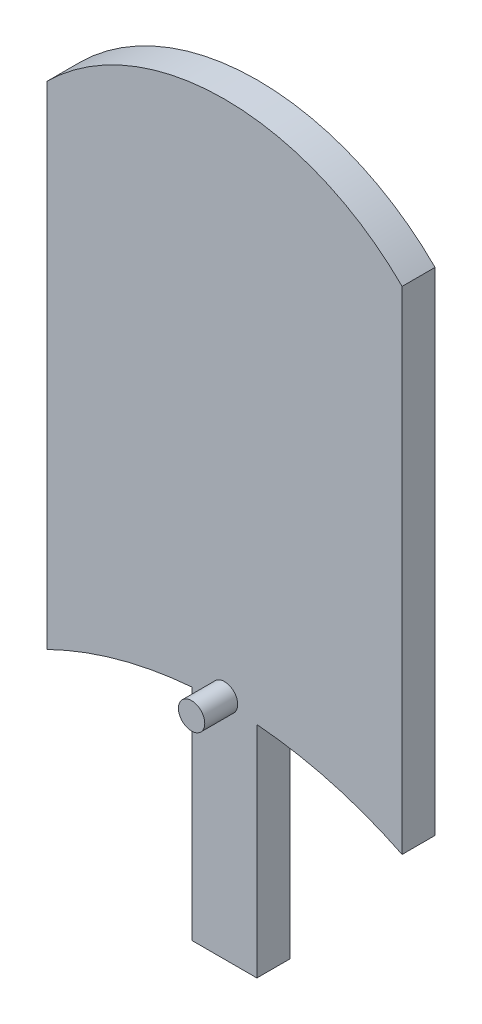
ISO-10303-21;
HEADER;
FILE_DESCRIPTION(('STEP AP214'),'2;1');
FILE_NAME('part.step','',(''),(''),'','','');
FILE_SCHEMA(('AUTOMOTIVE_DESIGN { 1 0 10303 214 1 1 1 1 }'));
ENDSEC;
DATA;
#1=APPLICATION_CONTEXT('core data for automotive mechanical design processes');
#2=APPLICATION_PROTOCOL_DEFINITION('international standard','automotive_design',2000,#1);
#3=PRODUCT_CONTEXT('',#1,'mechanical');
#4=PRODUCT('Part','Part','',(#3));
#5=PRODUCT_RELATED_PRODUCT_CATEGORY('part','',(#4));
#6=PRODUCT_DEFINITION_FORMATION('','',#4);
#7=PRODUCT_DEFINITION_CONTEXT('part definition',#1,'design');
#8=PRODUCT_DEFINITION('design','',#6,#7);
#9=PRODUCT_DEFINITION_SHAPE('','',#8);
#10=(LENGTH_UNIT() NAMED_UNIT(*) SI_UNIT(.MILLI.,.METRE.));
#11=(NAMED_UNIT(*) PLANE_ANGLE_UNIT() SI_UNIT($,.RADIAN.));
#12=(NAMED_UNIT(*) SI_UNIT($,.STERADIAN.) SOLID_ANGLE_UNIT());
#13=UNCERTAINTY_MEASURE_WITH_UNIT(LENGTH_MEASURE(1.E-05),#10,'distance_accuracy_value','');
#14=(GEOMETRIC_REPRESENTATION_CONTEXT(3) GLOBAL_UNCERTAINTY_ASSIGNED_CONTEXT((#13)) GLOBAL_UNIT_ASSIGNED_CONTEXT((#10,
#11,#12)) REPRESENTATION_CONTEXT('',''));
#15=CARTESIAN_POINT('',(0.,0.,0.));
#16=DIRECTION('',(0.,0.,1.));
#17=DIRECTION('',(1.,0.,0.));
#18=AXIS2_PLACEMENT_3D('',#15,#16,#17);
#19=CARTESIAN_POINT('',(0.,23.2983529403055,-3.175));
#20=DIRECTION('',(0.,1.,0.));
#21=DIRECTION('',(0.,0.,1.));
#22=AXIS2_PLACEMENT_3D('',#19,#20,#21);
#23=PLANE('',#22);
#24=DIRECTION('',(0.,0.,-1.));
#25=VECTOR('',#24,1.);
#26=CARTESIAN_POINT('',(1.01599999999999,23.2983529403055,6.351));
#27=LINE('',#26,#25);
#28=CARTESIAN_POINT('',(1.01599999999999,23.2983529403055,-2.286));
#29=VERTEX_POINT('',#28);
#30=CARTESIAN_POINT('',(1.01599999999999,23.2983529403055,-3.175));
#31=VERTEX_POINT('',#30);
#32=EDGE_CURVE('E703',#29,#31,#27,.T.);
#33=ORIENTED_EDGE('',*,*,#32,.F.);
#34=DIRECTION('',(1.,0.,0.));
#35=VECTOR('',#34,1.);
#36=CARTESIAN_POINT('',(-17.1162533328683,23.2983529403055,-2.286));
#37=LINE('',#36,#35);
#38=CARTESIAN_POINT('',(1.65128861988301,23.2983529403055,-2.286));
#39=VERTEX_POINT('',#38);
#40=EDGE_CURVE('E210',#29,#39,#37,.T.);
#41=ORIENTED_EDGE('',*,*,#40,.T.);
#42=DIRECTION('',(0.,0.,1.));
#43=VECTOR('',#42,1.);
#44=CARTESIAN_POINT('',(1.65128861988301,23.2983529403055,-3.175));
#45=LINE('',#44,#43);
#46=CARTESIAN_POINT('',(1.65128861988301,23.2983529403055,0.));
#47=VERTEX_POINT('',#46);
#48=EDGE_CURVE('E282',#39,#47,#45,.T.);
#49=ORIENTED_EDGE('',*,*,#48,.T.);
#50=DIRECTION('',(-1.,0.,0.));
#51=VECTOR('',#50,1.);
#52=CARTESIAN_POINT('',(0.,23.2983529403055,0.));
#53=LINE('',#52,#51);
#54=CARTESIAN_POINT('',(2.85342673515783,23.2983529403055,0.));
#55=VERTEX_POINT('',#54);
#56=EDGE_CURVE('E267',#55,#47,#53,.T.);
#57=ORIENTED_EDGE('',*,*,#56,.F.);
#58=DIRECTION('',(0.,0.,1.));
#59=VECTOR('',#58,1.);
#60=CARTESIAN_POINT('',(2.85342673515783,23.2983529403055,-3.175));
#61=LINE('',#60,#59);
#62=CARTESIAN_POINT('',(2.85342673515783,23.2983529403055,-3.175));
#63=VERTEX_POINT('',#62);
#64=EDGE_CURVE('E279',#63,#55,#61,.T.);
#65=ORIENTED_EDGE('',*,*,#64,.F.);
#66=DIRECTION('',(-1.,0.,0.));
#67=VECTOR('',#66,1.);
#68=CARTESIAN_POINT('',(0.,23.2983529403055,-3.175));
#69=LINE('',#68,#67);
#70=EDGE_CURVE('E253',#63,#31,#69,.T.);
#71=ORIENTED_EDGE('',*,*,#70,.T.);
#72=EDGE_LOOP('',(#33,#41,#49,#57,#65,#71));
#73=FACE_BOUND('',#72,.T.);
#74=ADVANCED_FACE('F45',(#73),#23,.T.);
#75=CARTESIAN_POINT('',(0.,0.,-3.175));
#76=DIRECTION('',(0.,0.,-1.));
#77=DIRECTION('',(-1.,0.,0.));
#78=AXIS2_PLACEMENT_3D('',#75,#76,#77);
#79=PLANE('',#78);
#80=DIRECTION('',(0.,-1.,0.));
#81=VECTOR('',#80,1.);
#82=CARTESIAN_POINT('',(1.01599999999999,-19.7679282566195,-3.175));
#83=LINE('',#82,#81);
#84=CARTESIAN_POINT('',(1.016,-19.7679282566195,-3.175));
#85=VERTEX_POINT('',#84);
#86=EDGE_CURVE('E68',#31,#85,#83,.T.);
#87=ORIENTED_EDGE('',*,*,#86,.F.);
#88=ORIENTED_EDGE('',*,*,#70,.F.);
#89=DIRECTION('',(0.,1.,0.));
#90=VECTOR('',#89,1.);
#91=CARTESIAN_POINT('',(2.85342673515783,0.,-3.175));
#92=LINE('',#91,#90);
#93=CARTESIAN_POINT('',(2.85342673515783,-19.8377816235629,-3.175));
#94=VERTEX_POINT('',#93);
#95=EDGE_CURVE('E256',#94,#63,#92,.T.);
#96=ORIENTED_EDGE('',*,*,#95,.F.);
#97=CARTESIAN_POINT('',(0.,-58.5646946603465,-3.175));
#98=DIRECTION('',(0.,0.,-1.));
#99=DIRECTION('',(-1.,0.,0.));
#100=AXIS2_PLACEMENT_3D('',#97,#98,#99);
#101=CIRCLE('',#100,38.8318920153463);
#102=CARTESIAN_POINT('',(1.65128861988301,-19.7679282566195,-3.175));
#103=VERTEX_POINT('',#102);
#104=EDGE_CURVE('E260',#94,#103,#101,.F.);
#105=ORIENTED_EDGE('',*,*,#104,.T.);
#106=DIRECTION('',(1.,0.,0.));
#107=VECTOR('',#106,1.);
#108=CARTESIAN_POINT('',(-17.1162533328683,-19.7679282566195,-3.175));
#109=LINE('',#108,#107);
#110=EDGE_CURVE('E700',#85,#103,#109,.T.);
#111=ORIENTED_EDGE('',*,*,#110,.F.);
#112=EDGE_LOOP('',(#87,#88,#96,#105,#111));
#113=FACE_BOUND('',#112,.T.);
#114=ADVANCED_FACE('F391',(#113),#79,.T.);
#115=CARTESIAN_POINT('',(-17.1162533328683,23.2983529403055,-2.286));
#116=DIRECTION('',(0.,0.,-1.));
#117=DIRECTION('',(0.,1.,0.));
#118=AXIS2_PLACEMENT_3D('',#115,#116,#117);
#119=PLANE('',#118);
#120=ORIENTED_EDGE('',*,*,#40,.F.);
#121=DIRECTION('',(0.,1.,0.));
#122=VECTOR('',#121,1.);
#123=CARTESIAN_POINT('',(1.01599999999999,-19.7679282566195,-2.28599999999999));
#124=LINE('',#123,#122);
#125=CARTESIAN_POINT('',(1.01599999999999,-19.7679282566195,-2.28599999999999));
#126=VERTEX_POINT('',#125);
#127=EDGE_CURVE('E203',#126,#29,#124,.T.);
#128=ORIENTED_EDGE('',*,*,#127,.F.);
#129=DIRECTION('',(1.,0.,0.));
#130=VECTOR('',#129,1.);
#131=CARTESIAN_POINT('',(-17.1162533328683,-19.7679282566195,-2.28599999999999));
#132=LINE('',#131,#130);
#133=CARTESIAN_POINT('',(1.65128861988301,-19.7679282566195,-2.28599999999999));
#134=VERTEX_POINT('',#133);
#135=EDGE_CURVE('E697',#126,#134,#132,.T.);
#136=ORIENTED_EDGE('',*,*,#135,.T.);
#137=DIRECTION('',(0.,1.,0.));
#138=VECTOR('',#137,1.);
#139=CARTESIAN_POINT('',(1.65128861988301,23.2983529403055,-2.286));
#140=LINE('',#139,#138);
#141=EDGE_CURVE('E209',#134,#39,#140,.T.);
#142=ORIENTED_EDGE('',*,*,#141,.T.);
#143=EDGE_LOOP('',(#120,#128,#136,#142));
#144=FACE_BOUND('',#143,.T.);
#145=ADVANCED_FACE('F398',(#144),#119,.F.);
#146=CARTESIAN_POINT('',(-17.1162533328683,-19.7679282566195,-2.28599999999999));
#147=DIRECTION('',(0.,1.,0.));
#148=DIRECTION('',(0.,0.,1.));
#149=AXIS2_PLACEMENT_3D('',#146,#147,#148);
#150=PLANE('',#149);
#151=ORIENTED_EDGE('',*,*,#135,.F.);
#152=DIRECTION('',(0.,0.,-1.));
#153=VECTOR('',#152,1.);
#154=CARTESIAN_POINT('',(1.01599999999999,-19.7679282566195,6.351));
#155=LINE('',#154,#153);
#156=EDGE_CURVE('E704',#126,#85,#155,.T.);
#157=ORIENTED_EDGE('',*,*,#156,.T.);
#158=ORIENTED_EDGE('',*,*,#110,.T.);
#159=DIRECTION('',(0.,0.,1.));
#160=VECTOR('',#159,1.);
#161=CARTESIAN_POINT('',(1.65128861988301,-19.7679282566195,-3.175));
#162=LINE('',#161,#160);
#163=EDGE_CURVE('E273',#103,#134,#162,.T.);
#164=ORIENTED_EDGE('',*,*,#163,.T.);
#165=EDGE_LOOP('',(#151,#157,#158,#164));
#166=FACE_BOUND('',#165,.T.);
#167=ADVANCED_FACE('F434',(#166),#150,.F.);
#168=CARTESIAN_POINT('',(-1.65128861988301,0.,-3.175));
#169=DIRECTION('',(1.,0.,0.));
#170=DIRECTION('',(0.,0.,-1.));
#171=AXIS2_PLACEMENT_3D('',#168,#169,#170);
#172=PLANE('',#171);
#173=DIRECTION('',(0.,0.,1.));
#174=VECTOR('',#173,1.);
#175=CARTESIAN_POINT('',(-1.65128861988301,-19.7679282566195,-3.175));
#176=LINE('',#175,#174);
#177=CARTESIAN_POINT('',(-1.65128861988301,-19.7679282566195,-2.28599999999999));
#178=VERTEX_POINT('',#177);
#179=CARTESIAN_POINT('',(-1.65128861988301,-19.7679282566195,0.));
#180=VERTEX_POINT('',#179);
#181=EDGE_CURVE('E292',#178,#180,#176,.T.);
#182=ORIENTED_EDGE('',*,*,#181,.F.);
#183=DIRECTION('',(0.,-1.,0.));
#184=VECTOR('',#183,1.);
#185=CARTESIAN_POINT('',(-1.65128861988301,23.2983529403055,-2.286));
#186=LINE('',#185,#184);
#187=CARTESIAN_POINT('',(-1.65128861988301,23.2983529403055,-2.286));
#188=VERTEX_POINT('',#187);
#189=EDGE_CURVE('E192',#188,#178,#186,.T.);
#190=ORIENTED_EDGE('',*,*,#189,.F.);
#191=DIRECTION('',(0.,0.,1.));
#192=VECTOR('',#191,1.);
#193=CARTESIAN_POINT('',(-1.65128861988301,23.2983529403055,-3.175));
#194=LINE('',#193,#192);
#195=CARTESIAN_POINT('',(-1.65128861988301,23.2983529403055,0.));
#196=VERTEX_POINT('',#195);
#197=EDGE_CURVE('E208',#188,#196,#194,.T.);
#198=ORIENTED_EDGE('',*,*,#197,.T.);
#199=DIRECTION('',(0.,1.,0.));
#200=VECTOR('',#199,1.);
#201=CARTESIAN_POINT('',(-1.65128861988301,0.,0.));
#202=LINE('',#201,#200);
#203=EDGE_CURVE('E289',#180,#196,#202,.T.);
#204=ORIENTED_EDGE('',*,*,#203,.F.);
#205=EDGE_LOOP('',(#182,#190,#198,#204));
#206=FACE_BOUND('',#205,.T.);
#207=ADVANCED_FACE('F481',(#206),#172,.T.);
#208=CARTESIAN_POINT('',(1.65128861988301,0.,-3.175));
#209=DIRECTION('',(1.,0.,0.));
#210=DIRECTION('',(0.,0.,-1.));
#211=AXIS2_PLACEMENT_3D('',#208,#209,#210);
#212=PLANE('',#211);
#213=ORIENTED_EDGE('',*,*,#141,.F.);
#214=CARTESIAN_POINT('',(1.65128861988301,-19.7679282566195,0.));
#215=VERTEX_POINT('',#214);
#216=EDGE_CURVE('E263',#134,#215,#162,.T.);
#217=ORIENTED_EDGE('',*,*,#216,.T.);
#218=DIRECTION('',(0.,1.,0.));
#219=VECTOR('',#218,1.);
#220=CARTESIAN_POINT('',(1.65128861988301,0.,0.));
#221=LINE('',#220,#219);
#222=EDGE_CURVE('E264',#215,#47,#221,.T.);
#223=ORIENTED_EDGE('',*,*,#222,.T.);
#224=ORIENTED_EDGE('',*,*,#48,.F.);
#225=EDGE_LOOP('',(#213,#217,#223,#224));
#226=FACE_BOUND('',#225,.T.);
#227=ADVANCED_FACE('F500',(#226),#212,.F.);
#228=CARTESIAN_POINT('',(0.,-58.5646946603465,3.175));
#229=DIRECTION('',(0.,0.,-1.));
#230=DIRECTION('',(-1.,0.,0.));
#231=AXIS2_PLACEMENT_3D('',#228,#229,#230);
#232=CYLINDRICAL_SURFACE('',#231,38.8318920153463);
#233=CARTESIAN_POINT('',(0.,-58.5646946603465,3.175));
#234=DIRECTION('',(0.,0.,1.));
#235=DIRECTION('',(1.,0.,0.));
#236=AXIS2_PLACEMENT_3D('',#233,#234,#235);
#237=CIRCLE('',#236,38.8318920153463);
#238=CARTESIAN_POINT('',(3.11847985069032,-19.8582233549904,3.175));
#239=VERTEX_POINT('',#238);
#240=CARTESIAN_POINT('',(17.1142533328683,-23.707583903,3.175));
#241=VERTEX_POINT('',#240);
#242=EDGE_CURVE('E315',#239,#241,#237,.F.);
#243=ORIENTED_EDGE('',*,*,#242,.F.);
#244=DIRECTION('',(0.,0.,-1.));
#245=VECTOR('',#244,1.);
#246=CARTESIAN_POINT('',(3.11847985069032,-19.8582233549904,3.175));
#247=LINE('',#246,#245);
#248=CARTESIAN_POINT('',(3.11847985069032,-19.8582233549904,0.));
#249=VERTEX_POINT('',#248);
#250=EDGE_CURVE('E249',#239,#249,#247,.T.);
#251=ORIENTED_EDGE('',*,*,#250,.T.);
#252=CARTESIAN_POINT('',(0.,-58.5646946603465,0.));
#253=DIRECTION('',(0.,0.,1.));
#254=DIRECTION('',(1.,0.,0.));
#255=AXIS2_PLACEMENT_3D('',#252,#253,#254);
#256=CIRCLE('',#255,38.8318920153463);
#257=CARTESIAN_POINT('',(17.1142533328683,-23.707583903,0.));
#258=VERTEX_POINT('',#257);
#259=EDGE_CURVE('E327',#249,#258,#256,.F.);
#260=ORIENTED_EDGE('',*,*,#259,.T.);
#261=DIRECTION('',(0.,0.,-1.));
#262=VECTOR('',#261,1.);
#263=CARTESIAN_POINT('',(17.1142533328683,-23.707583903,3.175));
#264=LINE('',#263,#262);
#265=EDGE_CURVE('E334',#241,#258,#264,.T.);
#266=ORIENTED_EDGE('',*,*,#265,.F.);
#267=EDGE_LOOP('',(#243,#251,#260,#266));
#268=FACE_BOUND('',#267,.T.);
#269=ADVANCED_FACE('F362',(#268),#232,.F.);
#270=CARTESIAN_POINT('',(0.,-58.5646946603465,0.));
#271=DIRECTION('',(0.,0.,1.));
#272=DIRECTION('',(1.,0.,0.));
#273=AXIS2_PLACEMENT_3D('',#270,#271,#272);
#274=CIRCLE('',#273,38.8318920153463);
#275=CARTESIAN_POINT('',(-2.85342673515783,-19.8377816235629,0.));
#276=VERTEX_POINT('',#275);
#277=EDGE_CURVE('E243',#276,#180,#274,.F.);
#278=ORIENTED_EDGE('',*,*,#277,.F.);
#279=DIRECTION('',(0.,0.,1.));
#280=VECTOR('',#279,1.);
#281=CARTESIAN_POINT('',(-2.85342673515783,-19.8377816235629,-3.175));
#282=LINE('',#281,#280);
#283=CARTESIAN_POINT('',(-2.85342673515783,-19.8377816235629,-3.175));
#284=VERTEX_POINT('',#283);
#285=EDGE_CURVE('E268',#284,#276,#282,.T.);
#286=ORIENTED_EDGE('',*,*,#285,.F.);
#287=CARTESIAN_POINT('',(0.,-58.5646946603465,-3.175));
#288=DIRECTION('',(0.,0.,-1.));
#289=DIRECTION('',(-1.,0.,0.));
#290=AXIS2_PLACEMENT_3D('',#287,#288,#289);
#291=CIRCLE('',#290,38.8318920153463);
#292=CARTESIAN_POINT('',(-1.65128861988301,-19.7679282566195,-3.175));
#293=VERTEX_POINT('',#292);
#294=EDGE_CURVE('E285',#293,#284,#291,.F.);
#295=ORIENTED_EDGE('',*,*,#294,.F.);
#296=EDGE_CURVE('E299',#293,#178,#176,.T.);
#297=ORIENTED_EDGE('',*,*,#296,.T.);
#298=ORIENTED_EDGE('',*,*,#181,.T.);
#299=EDGE_LOOP('',(#278,#286,#295,#297,#298));
#300=FACE_BOUND('',#299,.T.);
#301=ADVANCED_FACE('F547',(#300),#232,.F.);
#302=CARTESIAN_POINT('',(2.85342673515783,-19.8377816235629,0.));
#303=VERTEX_POINT('',#302);
#304=EDGE_CURVE('E240',#215,#303,#274,.F.);
#305=ORIENTED_EDGE('',*,*,#304,.F.);
#306=ORIENTED_EDGE('',*,*,#216,.F.);
#307=ORIENTED_EDGE('',*,*,#163,.F.);
#308=ORIENTED_EDGE('',*,*,#104,.F.);
#309=DIRECTION('',(0.,0.,1.));
#310=VECTOR('',#309,1.);
#311=CARTESIAN_POINT('',(2.85342673515783,-19.8377816235629,-3.175));
#312=LINE('',#311,#310);
#313=EDGE_CURVE('E276',#94,#303,#312,.T.);
#314=ORIENTED_EDGE('',*,*,#313,.T.);
#315=EDGE_LOOP('',(#305,#306,#307,#308,#314));
#316=FACE_BOUND('',#315,.T.);
#317=ADVANCED_FACE('F558',(#316),#232,.F.);
#318=CARTESIAN_POINT('',(0.,0.,0.));
#319=DIRECTION('',(0.,0.,1.));
#320=DIRECTION('',(1.,0.,0.));
#321=AXIS2_PLACEMENT_3D('',#318,#319,#320);
#322=PLANE('',#321);
#323=DIRECTION('',(0.,-1.,0.));
#324=VECTOR('',#323,1.);
#325=CARTESIAN_POINT('',(-3.11847985069048,0.338888516574709,0.));
#326=LINE('',#325,#324);
#327=CARTESIAN_POINT('',(-3.11847985069048,-19.8582233549905,0.));
#328=VERTEX_POINT('',#327);
#329=CARTESIAN_POINT('',(-3.11847985069047,-41.0138230374253,0.));
#330=VERTEX_POINT('',#329);
#331=EDGE_CURVE('E226',#328,#330,#326,.T.);
#332=ORIENTED_EDGE('',*,*,#331,.F.);
#333=CARTESIAN_POINT('',(-17.1142533328683,-23.707583903,0.));
#334=VERTEX_POINT('',#333);
#335=EDGE_CURVE('E328',#334,#328,#256,.F.);
#336=ORIENTED_EDGE('',*,*,#335,.F.);
#337=DIRECTION('',(0.,1.,0.));
#338=VECTOR('',#337,1.);
#339=CARTESIAN_POINT('',(-17.1142533328683,0.,0.));
#340=LINE('',#339,#338);
#341=CARTESIAN_POINT('',(-17.1142533328683,23.707583903,0.));
#342=VERTEX_POINT('',#341);
#343=EDGE_CURVE('E324',#334,#342,#340,.T.);
#344=ORIENTED_EDGE('',*,*,#343,.T.);
#345=CARTESIAN_POINT('',(0.,6.54428719014116,0.));
#346=DIRECTION('',(0.,0.,1.));
#347=DIRECTION('',(1.,0.,0.));
#348=AXIS2_PLACEMENT_3D('',#345,#346,#347);
#349=CIRCLE('',#348,24.2379128885971);
#350=CARTESIAN_POINT('',(17.1142533328683,23.707583903,0.));
#351=VERTEX_POINT('',#350);
#352=EDGE_CURVE('E284',#342,#351,#349,.F.);
#353=ORIENTED_EDGE('',*,*,#352,.T.);
#354=DIRECTION('',(0.,1.,0.));
#355=VECTOR('',#354,1.);
#356=CARTESIAN_POINT('',(17.1142533328683,0.,0.));
#357=LINE('',#356,#355);
#358=EDGE_CURVE('E312',#258,#351,#357,.T.);
#359=ORIENTED_EDGE('',*,*,#358,.F.);
#360=ORIENTED_EDGE('',*,*,#259,.F.);
#361=DIRECTION('',(0.,1.,0.));
#362=VECTOR('',#361,1.);
#363=CARTESIAN_POINT('',(3.11847985069032,0.338888516574709,0.));
#364=LINE('',#363,#362);
#365=CARTESIAN_POINT('',(3.11847985069032,-41.0138230374253,0.));
#366=VERTEX_POINT('',#365);
#367=EDGE_CURVE('E224',#366,#249,#364,.T.);
#368=ORIENTED_EDGE('',*,*,#367,.F.);
#369=DIRECTION('',(1.,0.,0.));
#370=VECTOR('',#369,1.);
#371=CARTESIAN_POINT('',(-3.11847985069047,-41.0138230374253,0.));
#372=LINE('',#371,#370);
#373=EDGE_CURVE('E229',#330,#366,#372,.T.);
#374=ORIENTED_EDGE('',*,*,#373,.F.);
#375=EDGE_LOOP('',(#332,#336,#344,#353,#359,#360,#368,#374));
#376=FACE_BOUND('',#375,.T.);
#377=DIRECTION('',(0.,1.,0.));
#378=VECTOR('',#377,1.);
#379=CARTESIAN_POINT('',(2.85342673515783,0.,0.));
#380=LINE('',#379,#378);
#381=EDGE_CURVE('E271',#303,#55,#380,.T.);
#382=ORIENTED_EDGE('',*,*,#381,.T.);
#383=ORIENTED_EDGE('',*,*,#56,.T.);
#384=ORIENTED_EDGE('',*,*,#222,.F.);
#385=ORIENTED_EDGE('',*,*,#304,.T.);
#386=EDGE_LOOP('',(#382,#383,#384,#385));
#387=FACE_BOUND('',#386,.T.);
#388=ORIENTED_EDGE('',*,*,#203,.T.);
#389=DIRECTION('',(-1.,0.,0.));
#390=VECTOR('',#389,1.);
#391=CARTESIAN_POINT('',(0.,23.2983529403055,0.));
#392=LINE('',#391,#390);
#393=CARTESIAN_POINT('',(-2.85342673515783,23.2983529403055,0.));
#394=VERTEX_POINT('',#393);
#395=EDGE_CURVE('E294',#196,#394,#392,.T.);
#396=ORIENTED_EDGE('',*,*,#395,.T.);
#397=DIRECTION('',(0.,1.,0.));
#398=VECTOR('',#397,1.);
#399=CARTESIAN_POINT('',(-2.85342673515783,0.,0.));
#400=LINE('',#399,#398);
#401=EDGE_CURVE('E252',#276,#394,#400,.T.);
#402=ORIENTED_EDGE('',*,*,#401,.F.);
#403=ORIENTED_EDGE('',*,*,#277,.T.);
#404=EDGE_LOOP('',(#388,#396,#402,#403));
#405=FACE_BOUND('',#404,.T.);
#406=ADVANCED_FACE('F345',(#376,#387,#405),#322,.F.);
#407=CARTESIAN_POINT('',(0.,6.54428719014116,3.175));
#408=DIRECTION('',(0.,0.,-1.));
#409=DIRECTION('',(-1.,0.,0.));
#410=AXIS2_PLACEMENT_3D('',#407,#408,#409);
#411=CYLINDRICAL_SURFACE('',#410,24.2379128885971);
#412=ORIENTED_EDGE('',*,*,#352,.F.);
#413=DIRECTION('',(0.,0.,-1.));
#414=VECTOR('',#413,1.);
#415=CARTESIAN_POINT('',(-17.1142533328683,23.707583903,3.175));
#416=LINE('',#415,#414);
#417=CARTESIAN_POINT('',(-17.1142533328683,23.707583903,3.175));
#418=VERTEX_POINT('',#417);
#419=EDGE_CURVE('E11',#418,#342,#416,.T.);
#420=ORIENTED_EDGE('',*,*,#419,.F.);
#421=CARTESIAN_POINT('',(0.,6.54428719014116,3.175));
#422=DIRECTION('',(0.,0.,1.));
#423=DIRECTION('',(1.,0.,0.));
#424=AXIS2_PLACEMENT_3D('',#421,#422,#423);
#425=CIRCLE('',#424,24.2379128885971);
#426=CARTESIAN_POINT('',(17.1142533328683,23.707583903,3.175));
#427=VERTEX_POINT('',#426);
#428=EDGE_CURVE('E308',#418,#427,#425,.F.);
#429=ORIENTED_EDGE('',*,*,#428,.T.);
#430=DIRECTION('',(0.,0.,-1.));
#431=VECTOR('',#430,1.);
#432=CARTESIAN_POINT('',(17.1142533328683,23.707583903,3.175));
#433=LINE('',#432,#431);
#434=EDGE_CURVE('E321',#427,#351,#433,.T.);
#435=ORIENTED_EDGE('',*,*,#434,.T.);
#436=EDGE_LOOP('',(#412,#420,#429,#435));
#437=FACE_BOUND('',#436,.T.);
#438=ADVANCED_FACE('F47',(#437),#411,.T.);
#439=CARTESIAN_POINT('',(-17.1142533328683,0.,3.175));
#440=DIRECTION('',(-1.,0.,0.));
#441=DIRECTION('',(0.,0.,1.));
#442=AXIS2_PLACEMENT_3D('',#439,#440,#441);
#443=PLANE('',#442);
#444=ORIENTED_EDGE('',*,*,#343,.F.);
#445=DIRECTION('',(0.,0.,-1.));
#446=VECTOR('',#445,1.);
#447=CARTESIAN_POINT('',(-17.1142533328683,-23.707583903,3.175));
#448=LINE('',#447,#446);
#449=CARTESIAN_POINT('',(-17.1142533328683,-23.707583903,3.175));
#450=VERTEX_POINT('',#449);
#451=EDGE_CURVE('E53',#450,#334,#448,.T.);
#452=ORIENTED_EDGE('',*,*,#451,.F.);
#453=DIRECTION('',(0.,1.,0.));
#454=VECTOR('',#453,1.);
#455=CARTESIAN_POINT('',(-17.1142533328683,0.,3.175));
#456=LINE('',#455,#454);
#457=EDGE_CURVE('E311',#450,#418,#456,.T.);
#458=ORIENTED_EDGE('',*,*,#457,.T.);
#459=ORIENTED_EDGE('',*,*,#419,.T.);
#460=EDGE_LOOP('',(#444,#452,#458,#459));
#461=FACE_BOUND('',#460,.T.);
#462=ADVANCED_FACE('F348',(#461),#443,.T.);
#463=ORIENTED_EDGE('',*,*,#335,.T.);
#464=DIRECTION('',(0.,0.,-1.));
#465=VECTOR('',#464,1.);
#466=CARTESIAN_POINT('',(-3.11847985069048,-19.8582233549905,3.175));
#467=LINE('',#466,#465);
#468=CARTESIAN_POINT('',(-3.11847985069048,-19.8582233549905,3.175));
#469=VERTEX_POINT('',#468);
#470=EDGE_CURVE('E246',#328,#469,#467,.F.);
#471=ORIENTED_EDGE('',*,*,#470,.T.);
#472=EDGE_CURVE('E316',#450,#469,#237,.F.);
#473=ORIENTED_EDGE('',*,*,#472,.F.);
#474=ORIENTED_EDGE('',*,*,#451,.T.);
#475=EDGE_LOOP('',(#463,#471,#473,#474));
#476=FACE_BOUND('',#475,.T.);
#477=ADVANCED_FACE('F339',(#476),#232,.F.);
#478=CARTESIAN_POINT('',(17.1142533328683,0.,3.175));
#479=DIRECTION('',(-1.,0.,0.));
#480=DIRECTION('',(0.,0.,1.));
#481=AXIS2_PLACEMENT_3D('',#478,#479,#480);
#482=PLANE('',#481);
#483=ORIENTED_EDGE('',*,*,#358,.T.);
#484=ORIENTED_EDGE('',*,*,#434,.F.);
#485=DIRECTION('',(0.,1.,0.));
#486=VECTOR('',#485,1.);
#487=CARTESIAN_POINT('',(17.1142533328683,0.,3.175));
#488=LINE('',#487,#486);
#489=EDGE_CURVE('E319',#241,#427,#488,.T.);
#490=ORIENTED_EDGE('',*,*,#489,.F.);
#491=ORIENTED_EDGE('',*,*,#265,.T.);
#492=EDGE_LOOP('',(#483,#484,#490,#491));
#493=FACE_BOUND('',#492,.T.);
#494=ADVANCED_FACE('F357',(#493),#482,.F.);
#495=CARTESIAN_POINT('',(0.,0.,3.175));
#496=DIRECTION('',(0.,0.,1.));
#497=DIRECTION('',(1.,0.,0.));
#498=AXIS2_PLACEMENT_3D('',#495,#496,#497);
#499=PLANE('',#498);
#500=CARTESIAN_POINT('',(0.,-19.1058230384253,3.175));
#501=DIRECTION('',(0.,0.,1.));
#502=DIRECTION('',(1.,0.,0.));
#503=AXIS2_PLACEMENT_3D('',#500,#501,#502);
#504=CIRCLE('',#503,1.27);
#505=CARTESIAN_POINT('',(1.27,-19.1058230384253,3.175));
#506=VERTEX_POINT('',#505);
#507=EDGE_CURVE('E213',#506,#506,#504,.T.);
#508=ORIENTED_EDGE('',*,*,#507,.F.);
#509=EDGE_LOOP('',(#508));
#510=FACE_BOUND('',#509,.T.);
#511=ORIENTED_EDGE('',*,*,#472,.T.);
#512=DIRECTION('',(0.,-1.,0.));
#513=VECTOR('',#512,1.);
#514=CARTESIAN_POINT('',(-3.11847985069048,0.338888516574709,3.175));
#515=LINE('',#514,#513);
#516=CARTESIAN_POINT('',(-3.11847985069047,-41.0138230374253,3.175));
#517=VERTEX_POINT('',#516);
#518=EDGE_CURVE('E234',#469,#517,#515,.T.);
#519=ORIENTED_EDGE('',*,*,#518,.T.);
#520=DIRECTION('',(1.,0.,0.));
#521=VECTOR('',#520,1.);
#522=CARTESIAN_POINT('',(-3.11847985069047,-41.0138230374253,3.175));
#523=LINE('',#522,#521);
#524=CARTESIAN_POINT('',(3.11847985069032,-41.0138230374253,3.175));
#525=VERTEX_POINT('',#524);
#526=EDGE_CURVE('E227',#517,#525,#523,.T.);
#527=ORIENTED_EDGE('',*,*,#526,.T.);
#528=DIRECTION('',(0.,1.,0.));
#529=VECTOR('',#528,1.);
#530=CARTESIAN_POINT('',(3.11847985069032,0.338888516574709,3.175));
#531=LINE('',#530,#529);
#532=EDGE_CURVE('E221',#525,#239,#531,.T.);
#533=ORIENTED_EDGE('',*,*,#532,.T.);
#534=ORIENTED_EDGE('',*,*,#242,.T.);
#535=ORIENTED_EDGE('',*,*,#489,.T.);
#536=ORIENTED_EDGE('',*,*,#428,.F.);
#537=ORIENTED_EDGE('',*,*,#457,.F.);
#538=EDGE_LOOP('',(#511,#519,#527,#533,#534,#535,#536,#537));
#539=FACE_BOUND('',#538,.T.);
#540=ADVANCED_FACE('F374',(#510,#539),#499,.T.);
#541=CARTESIAN_POINT('',(-2.85342673515783,0.,-3.175));
#542=DIRECTION('',(1.,0.,0.));
#543=DIRECTION('',(0.,0.,-1.));
#544=AXIS2_PLACEMENT_3D('',#541,#542,#543);
#545=PLANE('',#544);
#546=ORIENTED_EDGE('',*,*,#401,.T.);
#547=DIRECTION('',(0.,0.,1.));
#548=VECTOR('',#547,1.);
#549=CARTESIAN_POINT('',(-2.85342673515783,23.2983529403055,-3.175));
#550=LINE('',#549,#548);
#551=CARTESIAN_POINT('',(-2.85342673515783,23.2983529403055,-3.175));
#552=VERTEX_POINT('',#551);
#553=EDGE_CURVE('E303',#552,#394,#550,.T.);
#554=ORIENTED_EDGE('',*,*,#553,.F.);
#555=DIRECTION('',(0.,1.,0.));
#556=VECTOR('',#555,1.);
#557=CARTESIAN_POINT('',(-2.85342673515783,0.,-3.175));
#558=LINE('',#557,#556);
#559=EDGE_CURVE('E288',#284,#552,#558,.T.);
#560=ORIENTED_EDGE('',*,*,#559,.F.);
#561=ORIENTED_EDGE('',*,*,#285,.T.);
#562=EDGE_LOOP('',(#546,#554,#560,#561));
#563=FACE_BOUND('',#562,.T.);
#564=ADVANCED_FACE('F376',(#563),#545,.F.);
#565=DIRECTION('',(0.,0.,-1.));
#566=VECTOR('',#565,1.);
#567=CARTESIAN_POINT('',(-1.016,23.2983529403055,6.351));
#568=LINE('',#567,#566);
#569=CARTESIAN_POINT('',(-1.016,23.2983529403055,-2.286));
#570=VERTEX_POINT('',#569);
#571=CARTESIAN_POINT('',(-1.016,23.2983529403055,-3.175));
#572=VERTEX_POINT('',#571);
#573=EDGE_CURVE('E185',#570,#572,#568,.T.);
#574=ORIENTED_EDGE('',*,*,#573,.T.);
#575=EDGE_CURVE('E257',#572,#552,#69,.T.);
#576=ORIENTED_EDGE('',*,*,#575,.T.);
#577=ORIENTED_EDGE('',*,*,#553,.T.);
#578=ORIENTED_EDGE('',*,*,#395,.F.);
#579=ORIENTED_EDGE('',*,*,#197,.F.);
#580=EDGE_CURVE('E200',#188,#570,#37,.T.);
#581=ORIENTED_EDGE('',*,*,#580,.T.);
#582=EDGE_LOOP('',(#574,#576,#577,#578,#579,#581));
#583=FACE_BOUND('',#582,.T.);
#584=ADVANCED_FACE('F206',(#583),#23,.T.);
#585=CARTESIAN_POINT('',(2.85342673515783,0.,-3.175));
#586=DIRECTION('',(1.,0.,0.));
#587=DIRECTION('',(0.,0.,-1.));
#588=AXIS2_PLACEMENT_3D('',#585,#586,#587);
#589=PLANE('',#588);
#590=ORIENTED_EDGE('',*,*,#381,.F.);
#591=ORIENTED_EDGE('',*,*,#313,.F.);
#592=ORIENTED_EDGE('',*,*,#95,.T.);
#593=ORIENTED_EDGE('',*,*,#64,.T.);
#594=EDGE_LOOP('',(#590,#591,#592,#593));
#595=FACE_BOUND('',#594,.T.);
#596=ADVANCED_FACE('F406',(#595),#589,.T.);
#597=DIRECTION('',(0.,1.,0.));
#598=VECTOR('',#597,1.);
#599=CARTESIAN_POINT('',(-1.016,23.2983529403055,-3.175));
#600=LINE('',#599,#598);
#601=CARTESIAN_POINT('',(-1.01600000000001,-19.7679282566195,-3.175));
#602=VERTEX_POINT('',#601);
#603=EDGE_CURVE('E188',#602,#572,#600,.T.);
#604=ORIENTED_EDGE('',*,*,#603,.F.);
#605=EDGE_CURVE('E698',#293,#602,#109,.T.);
#606=ORIENTED_EDGE('',*,*,#605,.F.);
#607=ORIENTED_EDGE('',*,*,#294,.T.);
#608=ORIENTED_EDGE('',*,*,#559,.T.);
#609=ORIENTED_EDGE('',*,*,#575,.F.);
#610=EDGE_LOOP('',(#604,#606,#607,#608,#609));
#611=FACE_BOUND('',#610,.T.);
#612=ADVANCED_FACE('F401',(#611),#79,.T.);
#613=CARTESIAN_POINT('',(3.11847985069032,0.338888516574709,0.));
#614=DIRECTION('',(1.,0.,0.));
#615=DIRECTION('',(0.,1.,0.));
#616=AXIS2_PLACEMENT_3D('',#613,#614,#615);
#617=PLANE('',#616);
#618=ORIENTED_EDGE('',*,*,#250,.F.);
#619=ORIENTED_EDGE('',*,*,#532,.F.);
#620=DIRECTION('',(0.,0.,1.));
#621=VECTOR('',#620,1.);
#622=CARTESIAN_POINT('',(3.11847985069032,-41.0138230374253,0.));
#623=LINE('',#622,#621);
#624=EDGE_CURVE('E238',#366,#525,#623,.T.);
#625=ORIENTED_EDGE('',*,*,#624,.F.);
#626=ORIENTED_EDGE('',*,*,#367,.T.);
#627=EDGE_LOOP('',(#618,#619,#625,#626));
#628=FACE_BOUND('',#627,.T.);
#629=ADVANCED_FACE('F366',(#628),#617,.T.);
#630=CARTESIAN_POINT('',(-3.11847985069048,0.338888516574709,0.));
#631=DIRECTION('',(-1.,0.,0.));
#632=DIRECTION('',(0.,-1.,0.));
#633=AXIS2_PLACEMENT_3D('',#630,#631,#632);
#634=PLANE('',#633);
#635=ORIENTED_EDGE('',*,*,#470,.F.);
#636=ORIENTED_EDGE('',*,*,#331,.T.);
#637=DIRECTION('',(0.,0.,1.));
#638=VECTOR('',#637,1.);
#639=CARTESIAN_POINT('',(-3.11847985069047,-41.0138230374253,0.));
#640=LINE('',#639,#638);
#641=EDGE_CURVE('E232',#330,#517,#640,.T.);
#642=ORIENTED_EDGE('',*,*,#641,.T.);
#643=ORIENTED_EDGE('',*,*,#518,.F.);
#644=EDGE_LOOP('',(#635,#636,#642,#643));
#645=FACE_BOUND('',#644,.T.);
#646=ADVANCED_FACE('F372',(#645),#634,.T.);
#647=CARTESIAN_POINT('',(-3.11847985069047,-41.0138230374253,0.));
#648=DIRECTION('',(0.,-1.,0.));
#649=DIRECTION('',(0.,0.,-1.));
#650=AXIS2_PLACEMENT_3D('',#647,#648,#649);
#651=PLANE('',#650);
#652=ORIENTED_EDGE('',*,*,#526,.F.);
#653=ORIENTED_EDGE('',*,*,#641,.F.);
#654=ORIENTED_EDGE('',*,*,#373,.T.);
#655=ORIENTED_EDGE('',*,*,#624,.T.);
#656=EDGE_LOOP('',(#652,#653,#654,#655));
#657=FACE_BOUND('',#656,.T.);
#658=ADVANCED_FACE('F370',(#657),#651,.T.);
#659=CARTESIAN_POINT('',(0.,-19.1058230384253,6.35));
#660=DIRECTION('',(0.,0.,-1.));
#661=DIRECTION('',(-1.,0.,0.));
#662=AXIS2_PLACEMENT_3D('',#659,#660,#661);
#663=CYLINDRICAL_SURFACE('',#662,1.27);
#664=CARTESIAN_POINT('',(0.,-19.1058230384253,6.35));
#665=DIRECTION('',(0.,0.,1.));
#666=DIRECTION('',(1.,0.,0.));
#667=AXIS2_PLACEMENT_3D('',#664,#665,#666);
#668=CIRCLE('',#667,1.27);
#669=CARTESIAN_POINT('',(1.27,-19.1058230384253,6.35));
#670=VERTEX_POINT('',#669);
#671=EDGE_CURVE('E218',#670,#670,#668,.T.);
#672=ORIENTED_EDGE('',*,*,#671,.F.);
#673=EDGE_LOOP('',(#672));
#674=FACE_BOUND('',#673,.T.);
#675=ORIENTED_EDGE('',*,*,#507,.T.);
#676=EDGE_LOOP('',(#675));
#677=FACE_BOUND('',#676,.T.);
#678=ADVANCED_FACE('F423',(#674,#677),#663,.T.);
#679=CARTESIAN_POINT('',(0.,0.,6.35));
#680=DIRECTION('',(0.,0.,1.));
#681=DIRECTION('',(1.,0.,0.));
#682=AXIS2_PLACEMENT_3D('',#679,#680,#681);
#683=PLANE('',#682);
#684=ORIENTED_EDGE('',*,*,#671,.T.);
#685=EDGE_LOOP('',(#684));
#686=FACE_BOUND('',#685,.T.);
#687=ADVANCED_FACE('F425',(#686),#683,.T.);
#688=CARTESIAN_POINT('',(-1.01600000000001,-19.7679282566195,-2.28599999999999));
#689=VERTEX_POINT('',#688);
#690=EDGE_CURVE('E202',#178,#689,#132,.T.);
#691=ORIENTED_EDGE('',*,*,#690,.T.);
#692=DIRECTION('',(0.,-1.,0.));
#693=VECTOR('',#692,1.);
#694=CARTESIAN_POINT('',(-1.016,23.2983529403055,-2.286));
#695=LINE('',#694,#693);
#696=EDGE_CURVE('E60',#570,#689,#695,.T.);
#697=ORIENTED_EDGE('',*,*,#696,.F.);
#698=ORIENTED_EDGE('',*,*,#580,.F.);
#699=ORIENTED_EDGE('',*,*,#189,.T.);
#700=EDGE_LOOP('',(#691,#697,#698,#699));
#701=FACE_BOUND('',#700,.T.);
#702=ADVANCED_FACE('F198',(#701),#119,.F.);
#703=ORIENTED_EDGE('',*,*,#605,.T.);
#704=DIRECTION('',(0.,0.,-1.));
#705=VECTOR('',#704,1.);
#706=CARTESIAN_POINT('',(-1.01600000000001,-19.7679282566195,6.351));
#707=LINE('',#706,#705);
#708=EDGE_CURVE('E193',#689,#602,#707,.T.);
#709=ORIENTED_EDGE('',*,*,#708,.F.);
#710=ORIENTED_EDGE('',*,*,#690,.F.);
#711=ORIENTED_EDGE('',*,*,#296,.F.);
#712=EDGE_LOOP('',(#703,#709,#710,#711));
#713=FACE_BOUND('',#712,.T.);
#714=ADVANCED_FACE('F430',(#713),#150,.F.);
#715=CARTESIAN_POINT('',(-1.016,23.2983529403055,6.351));
#716=DIRECTION('',(-1.,0.,0.));
#717=DIRECTION('',(0.,-1.,0.));
#718=AXIS2_PLACEMENT_3D('',#715,#716,#717);
#719=PLANE('',#718);
#720=ORIENTED_EDGE('',*,*,#696,.T.);
#721=ORIENTED_EDGE('',*,*,#708,.T.);
#722=ORIENTED_EDGE('',*,*,#603,.T.);
#723=ORIENTED_EDGE('',*,*,#573,.F.);
#724=EDGE_LOOP('',(#720,#721,#722,#723));
#725=FACE_BOUND('',#724,.T.);
#726=ADVANCED_FACE('F186',(#725),#719,.F.);
#727=CARTESIAN_POINT('',(1.01599999999999,-19.7679282566195,6.351));
#728=DIRECTION('',(1.,0.,0.));
#729=DIRECTION('',(0.,0.,-1.));
#730=AXIS2_PLACEMENT_3D('',#727,#728,#729);
#731=PLANE('',#730);
#732=ORIENTED_EDGE('',*,*,#127,.T.);
#733=ORIENTED_EDGE('',*,*,#32,.T.);
#734=ORIENTED_EDGE('',*,*,#86,.T.);
#735=ORIENTED_EDGE('',*,*,#156,.F.);
#736=EDGE_LOOP('',(#732,#733,#734,#735));
#737=FACE_BOUND('',#736,.T.);
#738=ADVANCED_FACE('F437',(#737),#731,.F.);
#739=CLOSED_SHELL('',(#74,#114,#145,#167,#207,#227,#269,#301,#317,#406,#438,#462,#477,#494,#540,
#564,#584,#596,#612,#629,#646,#658,#678,#687,#702,#714,#726,#738));
#740=MANIFOLD_SOLID_BREP('B2',#739);
#741=ADVANCED_BREP_SHAPE_REPRESENTATION('',(#18,#740),#14);
#742=SHAPE_DEFINITION_REPRESENTATION(#9,#741);
ENDSEC;
END-ISO-10303-21;
